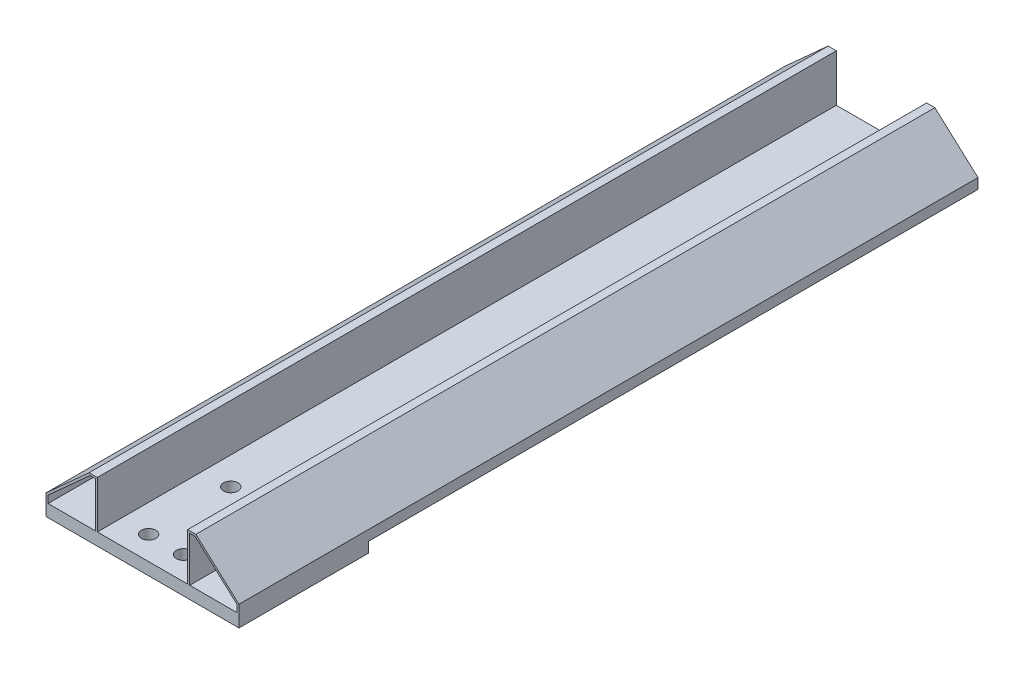
ISO-10303-21;
HEADER;
FILE_DESCRIPTION(('STEP AP214'),'2;1');
FILE_NAME('part.step','',(''),(''),'','','');
FILE_SCHEMA(('AUTOMOTIVE_DESIGN { 1 0 10303 214 1 1 1 1 }'));
ENDSEC;
DATA;
#1=APPLICATION_CONTEXT('core data for automotive mechanical design processes');
#2=APPLICATION_PROTOCOL_DEFINITION('international standard','automotive_design',2000,#1);
#3=PRODUCT_CONTEXT('',#1,'mechanical');
#4=PRODUCT('Part','Part','',(#3));
#5=PRODUCT_RELATED_PRODUCT_CATEGORY('part','',(#4));
#6=PRODUCT_DEFINITION_FORMATION('','',#4);
#7=PRODUCT_DEFINITION_CONTEXT('part definition',#1,'design');
#8=PRODUCT_DEFINITION('design','',#6,#7);
#9=PRODUCT_DEFINITION_SHAPE('','',#8);
#10=(LENGTH_UNIT() NAMED_UNIT(*) SI_UNIT(.MILLI.,.METRE.));
#11=(NAMED_UNIT(*) PLANE_ANGLE_UNIT() SI_UNIT($,.RADIAN.));
#12=(NAMED_UNIT(*) SI_UNIT($,.STERADIAN.) SOLID_ANGLE_UNIT());
#13=UNCERTAINTY_MEASURE_WITH_UNIT(LENGTH_MEASURE(1.E-05),#10,'distance_accuracy_value','');
#14=(GEOMETRIC_REPRESENTATION_CONTEXT(3) GLOBAL_UNCERTAINTY_ASSIGNED_CONTEXT((#13)) GLOBAL_UNIT_ASSIGNED_CONTEXT((#10,
#11,#12)) REPRESENTATION_CONTEXT('',''));
#15=CARTESIAN_POINT('',(0.,0.,0.));
#16=DIRECTION('',(0.,0.,1.));
#17=DIRECTION('',(1.,0.,0.));
#18=AXIS2_PLACEMENT_3D('',#15,#16,#17);
#19=CARTESIAN_POINT('',(0.,-24.,360.));
#20=DIRECTION('',(0.,1.,0.));
#21=DIRECTION('',(0.,0.,1.));
#22=AXIS2_PLACEMENT_3D('',#19,#20,#21);
#23=PLANE('',#22);
#24=DIRECTION('',(1.,0.,0.));
#25=VECTOR('',#24,1.);
#26=CARTESIAN_POINT('',(0.,-24.,297.));
#27=LINE('',#26,#25);
#28=CARTESIAN_POINT('',(0.,-24.,297.));
#29=VERTEX_POINT('',#28);
#30=CARTESIAN_POINT('',(94.,-24.,297.));
#31=VERTEX_POINT('',#30);
#32=EDGE_CURVE('E53',#29,#31,#27,.T.);
#33=ORIENTED_EDGE('',*,*,#32,.F.);
#34=DIRECTION('',(0.,0.,-1.));
#35=VECTOR('',#34,1.);
#36=CARTESIAN_POINT('',(0.,-24.,360.));
#37=LINE('',#36,#35);
#38=CARTESIAN_POINT('',(0.,-24.,0.));
#39=VERTEX_POINT('',#38);
#40=EDGE_CURVE('E11',#29,#39,#37,.T.);
#41=ORIENTED_EDGE('',*,*,#40,.T.);
#42=DIRECTION('',(1.,0.,0.));
#43=VECTOR('',#42,1.);
#44=CARTESIAN_POINT('',(0.,-24.,0.));
#45=LINE('',#44,#43);
#46=CARTESIAN_POINT('',(94.,-24.,0.));
#47=VERTEX_POINT('',#46);
#48=EDGE_CURVE('E348',#39,#47,#45,.T.);
#49=ORIENTED_EDGE('',*,*,#48,.T.);
#50=DIRECTION('',(0.,0.,-1.));
#51=VECTOR('',#50,1.);
#52=CARTESIAN_POINT('',(94.,-24.,360.));
#53=LINE('',#52,#51);
#54=EDGE_CURVE('E47',#31,#47,#53,.T.);
#55=ORIENTED_EDGE('',*,*,#54,.F.);
#56=EDGE_LOOP('',(#33,#41,#49,#55));
#57=FACE_BOUND('',#56,.T.);
#58=ADVANCED_FACE('F39',(#57),#23,.F.);
#59=CARTESIAN_POINT('',(94.,0.,360.));
#60=DIRECTION('',(-1.,0.,0.));
#61=DIRECTION('',(0.,0.,1.));
#62=AXIS2_PLACEMENT_3D('',#59,#60,#61);
#63=PLANE('',#62);
#64=DIRECTION('',(0.,0.,-1.));
#65=VECTOR('',#64,1.);
#66=CARTESIAN_POINT('',(94.,-19.,360.));
#67=LINE('',#66,#65);
#68=CARTESIAN_POINT('',(94.,-19.,360.));
#69=VERTEX_POINT('',#68);
#70=CARTESIAN_POINT('',(94.,-19.,0.));
#71=VERTEX_POINT('',#70);
#72=EDGE_CURVE('E298',#69,#71,#67,.T.);
#73=ORIENTED_EDGE('',*,*,#72,.F.);
#74=DIRECTION('',(0.,1.,0.));
#75=VECTOR('',#74,1.);
#76=CARTESIAN_POINT('',(94.,0.,360.));
#77=LINE('',#76,#75);
#78=CARTESIAN_POINT('',(94.,-29.,360.));
#79=VERTEX_POINT('',#78);
#80=EDGE_CURVE('E339',#79,#69,#77,.T.);
#81=ORIENTED_EDGE('',*,*,#80,.F.);
#82=DIRECTION('',(0.,0.,1.));
#83=VECTOR('',#82,1.);
#84=CARTESIAN_POINT('',(94.,-29.,360.));
#85=LINE('',#84,#83);
#86=CARTESIAN_POINT('',(94.,-29.,297.));
#87=VERTEX_POINT('',#86);
#88=EDGE_CURVE('E197',#87,#79,#85,.T.);
#89=ORIENTED_EDGE('',*,*,#88,.F.);
#90=DIRECTION('',(0.,1.,0.));
#91=VECTOR('',#90,1.);
#92=CARTESIAN_POINT('',(94.,-29.,297.));
#93=LINE('',#92,#91);
#94=EDGE_CURVE('E193',#87,#31,#93,.T.);
#95=ORIENTED_EDGE('',*,*,#94,.T.);
#96=ORIENTED_EDGE('',*,*,#54,.T.);
#97=DIRECTION('',(0.,1.,0.));
#98=VECTOR('',#97,1.);
#99=CARTESIAN_POINT('',(94.,0.,0.));
#100=LINE('',#99,#98);
#101=EDGE_CURVE('E351',#47,#71,#100,.T.);
#102=ORIENTED_EDGE('',*,*,#101,.T.);
#103=EDGE_LOOP('',(#73,#81,#89,#95,#96,#102));
#104=FACE_BOUND('',#103,.T.);
#105=ADVANCED_FACE('F441',(#104),#63,.F.);
#106=CARTESIAN_POINT('',(0.,0.,360.));
#107=DIRECTION('',(0.,-1.,0.));
#108=DIRECTION('',(0.,0.,-1.));
#109=AXIS2_PLACEMENT_3D('',#106,#107,#108);
#110=PLANE('',#109);
#111=DIRECTION('',(0.,0.,-1.));
#112=VECTOR('',#111,1.);
#113=CARTESIAN_POINT('',(73.,0.,360.));
#114=LINE('',#113,#112);
#115=CARTESIAN_POINT('',(73.,0.,360.));
#116=VERTEX_POINT('',#115);
#117=CARTESIAN_POINT('',(73.,0.,0.));
#118=VERTEX_POINT('',#117);
#119=EDGE_CURVE('E293',#116,#118,#114,.T.);
#120=ORIENTED_EDGE('',*,*,#119,.T.);
#121=DIRECTION('',(-1.,0.,0.));
#122=VECTOR('',#121,1.);
#123=CARTESIAN_POINT('',(0.,0.,0.));
#124=LINE('',#123,#122);
#125=CARTESIAN_POINT('',(69.,0.,0.));
#126=VERTEX_POINT('',#125);
#127=EDGE_CURVE('E340',#118,#126,#124,.T.);
#128=ORIENTED_EDGE('',*,*,#127,.T.);
#129=DIRECTION('',(0.,0.,-1.));
#130=VECTOR('',#129,1.);
#131=CARTESIAN_POINT('',(69.,0.,360.));
#132=LINE('',#131,#130);
#133=CARTESIAN_POINT('',(69.,0.,360.));
#134=VERTEX_POINT('',#133);
#135=EDGE_CURVE('E322',#134,#126,#132,.T.);
#136=ORIENTED_EDGE('',*,*,#135,.F.);
#137=DIRECTION('',(-1.,0.,0.));
#138=VECTOR('',#137,1.);
#139=CARTESIAN_POINT('',(0.,0.,360.));
#140=LINE('',#139,#138);
#141=EDGE_CURVE('E346',#116,#134,#140,.T.);
#142=ORIENTED_EDGE('',*,*,#141,.F.);
#143=EDGE_LOOP('',(#120,#128,#136,#142));
#144=FACE_BOUND('',#143,.T.);
#145=ADVANCED_FACE('F366',(#144),#110,.F.);
#146=CARTESIAN_POINT('',(0.,0.,360.));
#147=DIRECTION('',(0.,0.,1.));
#148=DIRECTION('',(1.,0.,0.));
#149=AXIS2_PLACEMENT_3D('',#146,#147,#148);
#150=PLANE('',#149);
#151=DIRECTION('',(0.741535779123771,0.670913323969126,0.));
#152=VECTOR('',#151,1.);
#153=CARTESIAN_POINT('',(10.1235317778345,-11.189166701817,360.));
#154=LINE('',#153,#152);
#155=CARTESIAN_POINT('',(1.,-19.4437906912863,360.));
#156=VERTEX_POINT('',#155);
#157=CARTESIAN_POINT('',(21.3852423430007,-1.,360.));
#158=VERTEX_POINT('',#157);
#159=EDGE_CURVE('E216',#156,#158,#154,.T.);
#160=ORIENTED_EDGE('',*,*,#159,.T.);
#161=DIRECTION('',(1.,0.,0.));
#162=VECTOR('',#161,1.);
#163=CARTESIAN_POINT('',(0.,-1.,360.));
#164=LINE('',#163,#162);
#165=CARTESIAN_POINT('',(24.,-1.,360.));
#166=VERTEX_POINT('',#165);
#167=EDGE_CURVE('E219',#158,#166,#164,.T.);
#168=ORIENTED_EDGE('',*,*,#167,.T.);
#169=DIRECTION('',(0.,-1.,0.));
#170=VECTOR('',#169,1.);
#171=CARTESIAN_POINT('',(24.,0.,360.));
#172=LINE('',#171,#170);
#173=CARTESIAN_POINT('',(24.,-23.,360.));
#174=VERTEX_POINT('',#173);
#175=EDGE_CURVE('E61',#166,#174,#172,.T.);
#176=ORIENTED_EDGE('',*,*,#175,.T.);
#177=DIRECTION('',(-1.,0.,0.));
#178=VECTOR('',#177,1.);
#179=CARTESIAN_POINT('',(0.,-23.,360.));
#180=LINE('',#179,#178);
#181=CARTESIAN_POINT('',(1.,-23.,360.));
#182=VERTEX_POINT('',#181);
#183=EDGE_CURVE('E224',#174,#182,#180,.T.);
#184=ORIENTED_EDGE('',*,*,#183,.T.);
#185=DIRECTION('',(0.,1.,0.));
#186=VECTOR('',#185,1.);
#187=CARTESIAN_POINT('',(1.,0.,360.));
#188=LINE('',#187,#186);
#189=EDGE_CURVE('E227',#182,#156,#188,.T.);
#190=ORIENTED_EDGE('',*,*,#189,.T.);
#191=EDGE_LOOP('',(#160,#168,#176,#184,#190));
#192=FACE_BOUND('',#191,.T.);
#193=DIRECTION('',(0.,-1.,0.));
#194=VECTOR('',#193,1.);
#195=CARTESIAN_POINT('',(93.,0.,360.));
#196=LINE('',#195,#194);
#197=CARTESIAN_POINT('',(93.,-19.4437906912863,360.));
#198=VERTEX_POINT('',#197);
#199=CARTESIAN_POINT('',(93.,-23.,360.));
#200=VERTEX_POINT('',#199);
#201=EDGE_CURVE('E252',#198,#200,#196,.T.);
#202=ORIENTED_EDGE('',*,*,#201,.T.);
#203=DIRECTION('',(-1.,0.,0.));
#204=VECTOR('',#203,1.);
#205=CARTESIAN_POINT('',(0.,-23.,360.));
#206=LINE('',#205,#204);
#207=CARTESIAN_POINT('',(70.,-23.,360.));
#208=VERTEX_POINT('',#207);
#209=EDGE_CURVE('E255',#200,#208,#206,.T.);
#210=ORIENTED_EDGE('',*,*,#209,.T.);
#211=DIRECTION('',(0.,-1.,0.));
#212=VECTOR('',#211,1.);
#213=CARTESIAN_POINT('',(70.,0.,360.));
#214=LINE('',#213,#212);
#215=CARTESIAN_POINT('',(70.,-1.,360.));
#216=VERTEX_POINT('',#215);
#217=EDGE_CURVE('E259',#216,#208,#214,.T.);
#218=ORIENTED_EDGE('',*,*,#217,.F.);
#219=DIRECTION('',(-1.,0.,0.));
#220=VECTOR('',#219,1.);
#221=CARTESIAN_POINT('',(0.,-1.,360.));
#222=LINE('',#221,#220);
#223=CARTESIAN_POINT('',(72.6147576569993,-1.,360.));
#224=VERTEX_POINT('',#223);
#225=EDGE_CURVE('E262',#224,#216,#222,.T.);
#226=ORIENTED_EDGE('',*,*,#225,.F.);
#227=DIRECTION('',(0.741535779123771,-0.670913323969127,0.));
#228=VECTOR('',#227,1.);
#229=CARTESIAN_POINT('',(32.1881889204199,35.5764193330957,360.));
#230=LINE('',#229,#228);
#231=EDGE_CURVE('E264',#224,#198,#230,.T.);
#232=ORIENTED_EDGE('',*,*,#231,.T.);
#233=EDGE_LOOP('',(#202,#210,#218,#226,#232));
#234=FACE_BOUND('',#233,.T.);
#235=ORIENTED_EDGE('',*,*,#80,.T.);
#236=DIRECTION('',(0.741535779123771,-0.670913323969127,0.));
#237=VECTOR('',#236,1.);
#238=CARTESIAN_POINT('',(32.8591022443891,36.3179551122195,360.));
#239=LINE('',#238,#237);
#240=EDGE_CURVE('E291',#116,#69,#239,.T.);
#241=ORIENTED_EDGE('',*,*,#240,.F.);
#242=ORIENTED_EDGE('',*,*,#141,.T.);
#243=DIRECTION('',(0.,1.,0.));
#244=VECTOR('',#243,1.);
#245=CARTESIAN_POINT('',(69.,0.,360.));
#246=LINE('',#245,#244);
#247=CARTESIAN_POINT('',(69.,-23.,360.));
#248=VERTEX_POINT('',#247);
#249=EDGE_CURVE('E309',#248,#134,#246,.T.);
#250=ORIENTED_EDGE('',*,*,#249,.F.);
#251=DIRECTION('',(1.,0.,0.));
#252=VECTOR('',#251,1.);
#253=CARTESIAN_POINT('',(0.,-23.,360.));
#254=LINE('',#253,#252);
#255=CARTESIAN_POINT('',(25.,-23.,360.));
#256=VERTEX_POINT('',#255);
#257=EDGE_CURVE('E303',#256,#248,#254,.T.);
#258=ORIENTED_EDGE('',*,*,#257,.F.);
#259=DIRECTION('',(0.,1.,0.));
#260=VECTOR('',#259,1.);
#261=CARTESIAN_POINT('',(25.,0.,360.));
#262=LINE('',#261,#260);
#263=CARTESIAN_POINT('',(25.,0.,360.));
#264=VERTEX_POINT('',#263);
#265=EDGE_CURVE('E305',#256,#264,#262,.T.);
#266=ORIENTED_EDGE('',*,*,#265,.T.);
#267=CARTESIAN_POINT('',(21.,0.,360.));
#268=VERTEX_POINT('',#267);
#269=EDGE_CURVE('E343',#264,#268,#140,.T.);
#270=ORIENTED_EDGE('',*,*,#269,.T.);
#271=DIRECTION('',(-0.741535779123771,-0.670913323969126,0.));
#272=VECTOR('',#271,1.);
#273=CARTESIAN_POINT('',(9.45261845386534,-10.4476309226933,360.));
#274=LINE('',#273,#272);
#275=CARTESIAN_POINT('',(0.,-19.,360.));
#276=VERTEX_POINT('',#275);
#277=EDGE_CURVE('E329',#268,#276,#274,.T.);
#278=ORIENTED_EDGE('',*,*,#277,.T.);
#279=DIRECTION('',(0.,-1.,0.));
#280=VECTOR('',#279,1.);
#281=CARTESIAN_POINT('',(0.,0.,360.));
#282=LINE('',#281,#280);
#283=CARTESIAN_POINT('',(0.,-29.,360.));
#284=VERTEX_POINT('',#283);
#285=EDGE_CURVE('E337',#276,#284,#282,.T.);
#286=ORIENTED_EDGE('',*,*,#285,.T.);
#287=DIRECTION('',(-1.,0.,0.));
#288=VECTOR('',#287,1.);
#289=CARTESIAN_POINT('',(0.,-29.,360.));
#290=LINE('',#289,#288);
#291=EDGE_CURVE('E204',#79,#284,#290,.T.);
#292=ORIENTED_EDGE('',*,*,#291,.F.);
#293=EDGE_LOOP('',(#235,#241,#242,#250,#258,#266,#270,#278,#286,#292));
#294=FACE_BOUND('',#293,.T.);
#295=ADVANCED_FACE('F362',(#192,#234,#294),#150,.T.);
#296=CARTESIAN_POINT('',(0.,0.,0.));
#297=DIRECTION('',(0.,0.,1.));
#298=DIRECTION('',(1.,0.,0.));
#299=AXIS2_PLACEMENT_3D('',#296,#297,#298);
#300=PLANE('',#299);
#301=DIRECTION('',(1.,0.,0.));
#302=VECTOR('',#301,1.);
#303=CARTESIAN_POINT('',(0.,-1.,0.));
#304=LINE('',#303,#302);
#305=CARTESIAN_POINT('',(21.3852423430007,-1.,0.));
#306=VERTEX_POINT('',#305);
#307=CARTESIAN_POINT('',(24.,-1.,0.));
#308=VERTEX_POINT('',#307);
#309=EDGE_CURVE('E211',#306,#308,#304,.T.);
#310=ORIENTED_EDGE('',*,*,#309,.F.);
#311=DIRECTION('',(0.741535779123771,0.670913323969126,0.));
#312=VECTOR('',#311,1.);
#313=CARTESIAN_POINT('',(10.1235317778345,-11.189166701817,0.));
#314=LINE('',#313,#312);
#315=CARTESIAN_POINT('',(1.,-19.4437906912863,0.));
#316=VERTEX_POINT('',#315);
#317=EDGE_CURVE('E209',#316,#306,#314,.T.);
#318=ORIENTED_EDGE('',*,*,#317,.F.);
#319=DIRECTION('',(0.,1.,0.));
#320=VECTOR('',#319,1.);
#321=CARTESIAN_POINT('',(1.,0.,0.));
#322=LINE('',#321,#320);
#323=CARTESIAN_POINT('',(1.,-23.,0.));
#324=VERTEX_POINT('',#323);
#325=EDGE_CURVE('E220',#324,#316,#322,.T.);
#326=ORIENTED_EDGE('',*,*,#325,.F.);
#327=DIRECTION('',(-1.,0.,0.));
#328=VECTOR('',#327,1.);
#329=CARTESIAN_POINT('',(0.,-23.,0.));
#330=LINE('',#329,#328);
#331=CARTESIAN_POINT('',(24.,-23.,0.));
#332=VERTEX_POINT('',#331);
#333=EDGE_CURVE('E236',#332,#324,#330,.T.);
#334=ORIENTED_EDGE('',*,*,#333,.F.);
#335=DIRECTION('',(0.,-1.,0.));
#336=VECTOR('',#335,1.);
#337=CARTESIAN_POINT('',(24.,0.,0.));
#338=LINE('',#337,#336);
#339=EDGE_CURVE('E233',#308,#332,#338,.T.);
#340=ORIENTED_EDGE('',*,*,#339,.F.);
#341=EDGE_LOOP('',(#310,#318,#326,#334,#340));
#342=FACE_BOUND('',#341,.T.);
#343=DIRECTION('',(-1.,0.,0.));
#344=VECTOR('',#343,1.);
#345=CARTESIAN_POINT('',(0.,-23.,0.));
#346=LINE('',#345,#344);
#347=CARTESIAN_POINT('',(93.,-23.,0.));
#348=VERTEX_POINT('',#347);
#349=CARTESIAN_POINT('',(70.,-23.,0.));
#350=VERTEX_POINT('',#349);
#351=EDGE_CURVE('E269',#348,#350,#346,.T.);
#352=ORIENTED_EDGE('',*,*,#351,.F.);
#353=DIRECTION('',(0.,-1.,0.));
#354=VECTOR('',#353,1.);
#355=CARTESIAN_POINT('',(93.,0.,0.));
#356=LINE('',#355,#354);
#357=CARTESIAN_POINT('',(93.,-19.4437906912863,0.));
#358=VERTEX_POINT('',#357);
#359=EDGE_CURVE('E243',#358,#348,#356,.T.);
#360=ORIENTED_EDGE('',*,*,#359,.F.);
#361=DIRECTION('',(0.741535779123771,-0.670913323969127,0.));
#362=VECTOR('',#361,1.);
#363=CARTESIAN_POINT('',(32.1881889204199,35.5764193330957,0.));
#364=LINE('',#363,#362);
#365=CARTESIAN_POINT('',(72.6147576569993,-1.,0.));
#366=VERTEX_POINT('',#365);
#367=EDGE_CURVE('E256',#366,#358,#364,.T.);
#368=ORIENTED_EDGE('',*,*,#367,.F.);
#369=DIRECTION('',(-1.,0.,0.));
#370=VECTOR('',#369,1.);
#371=CARTESIAN_POINT('',(0.,-1.,0.));
#372=LINE('',#371,#370);
#373=CARTESIAN_POINT('',(70.,-1.,0.));
#374=VERTEX_POINT('',#373);
#375=EDGE_CURVE('E275',#366,#374,#372,.T.);
#376=ORIENTED_EDGE('',*,*,#375,.T.);
#377=DIRECTION('',(0.,-1.,0.));
#378=VECTOR('',#377,1.);
#379=CARTESIAN_POINT('',(70.,0.,0.));
#380=LINE('',#379,#378);
#381=EDGE_CURVE('E272',#374,#350,#380,.T.);
#382=ORIENTED_EDGE('',*,*,#381,.T.);
#383=EDGE_LOOP('',(#352,#360,#368,#376,#382));
#384=FACE_BOUND('',#383,.T.);
#385=DIRECTION('',(0.741535779123771,-0.670913323969127,0.));
#386=VECTOR('',#385,1.);
#387=CARTESIAN_POINT('',(32.8591022443891,36.3179551122195,0.));
#388=LINE('',#387,#386);
#389=EDGE_CURVE('E294',#118,#71,#388,.T.);
#390=ORIENTED_EDGE('',*,*,#389,.T.);
#391=ORIENTED_EDGE('',*,*,#101,.F.);
#392=ORIENTED_EDGE('',*,*,#48,.F.);
#393=DIRECTION('',(0.,-1.,0.));
#394=VECTOR('',#393,1.);
#395=CARTESIAN_POINT('',(0.,0.,0.));
#396=LINE('',#395,#394);
#397=CARTESIAN_POINT('',(0.,-19.,0.));
#398=VERTEX_POINT('',#397);
#399=EDGE_CURVE('E300',#398,#39,#396,.T.);
#400=ORIENTED_EDGE('',*,*,#399,.F.);
#401=DIRECTION('',(-0.741535779123771,-0.670913323969126,0.));
#402=VECTOR('',#401,1.);
#403=CARTESIAN_POINT('',(9.45261845386534,-10.4476309226933,0.));
#404=LINE('',#403,#402);
#405=CARTESIAN_POINT('',(21.,0.,0.));
#406=VERTEX_POINT('',#405);
#407=EDGE_CURVE('E282',#406,#398,#404,.T.);
#408=ORIENTED_EDGE('',*,*,#407,.F.);
#409=CARTESIAN_POINT('',(25.,0.,0.));
#410=VERTEX_POINT('',#409);
#411=EDGE_CURVE('E354',#410,#406,#124,.T.);
#412=ORIENTED_EDGE('',*,*,#411,.F.);
#413=DIRECTION('',(0.,1.,0.));
#414=VECTOR('',#413,1.);
#415=CARTESIAN_POINT('',(25.,0.,0.));
#416=LINE('',#415,#414);
#417=CARTESIAN_POINT('',(25.,-23.,0.));
#418=VERTEX_POINT('',#417);
#419=EDGE_CURVE('E315',#418,#410,#416,.T.);
#420=ORIENTED_EDGE('',*,*,#419,.F.);
#421=DIRECTION('',(1.,0.,0.));
#422=VECTOR('',#421,1.);
#423=CARTESIAN_POINT('',(0.,-23.,0.));
#424=LINE('',#423,#422);
#425=CARTESIAN_POINT('',(69.,-23.,0.));
#426=VERTEX_POINT('',#425);
#427=EDGE_CURVE('E312',#418,#426,#424,.T.);
#428=ORIENTED_EDGE('',*,*,#427,.T.);
#429=DIRECTION('',(0.,1.,0.));
#430=VECTOR('',#429,1.);
#431=CARTESIAN_POINT('',(69.,0.,0.));
#432=LINE('',#431,#430);
#433=EDGE_CURVE('E306',#426,#126,#432,.T.);
#434=ORIENTED_EDGE('',*,*,#433,.T.);
#435=ORIENTED_EDGE('',*,*,#127,.F.);
#436=EDGE_LOOP('',(#390,#391,#392,#400,#408,#412,#420,#428,#434,#435));
#437=FACE_BOUND('',#436,.T.);
#438=ADVANCED_FACE('F373',(#342,#384,#437),#300,.F.);
#439=CARTESIAN_POINT('',(0.,0.,360.));
#440=DIRECTION('',(1.,0.,0.));
#441=DIRECTION('',(0.,1.,0.));
#442=AXIS2_PLACEMENT_3D('',#439,#440,#441);
#443=PLANE('',#442);
#444=ORIENTED_EDGE('',*,*,#285,.F.);
#445=DIRECTION('',(0.,0.,-1.));
#446=VECTOR('',#445,1.);
#447=CARTESIAN_POINT('',(0.,-19.,360.));
#448=LINE('',#447,#446);
#449=EDGE_CURVE('E316',#276,#398,#448,.T.);
#450=ORIENTED_EDGE('',*,*,#449,.T.);
#451=ORIENTED_EDGE('',*,*,#399,.T.);
#452=ORIENTED_EDGE('',*,*,#40,.F.);
#453=DIRECTION('',(0.,1.,0.));
#454=VECTOR('',#453,1.);
#455=CARTESIAN_POINT('',(0.,-29.,297.));
#456=LINE('',#455,#454);
#457=CARTESIAN_POINT('',(0.,-29.,297.));
#458=VERTEX_POINT('',#457);
#459=EDGE_CURVE('E191',#458,#29,#456,.T.);
#460=ORIENTED_EDGE('',*,*,#459,.F.);
#461=DIRECTION('',(0.,0.,-1.));
#462=VECTOR('',#461,1.);
#463=CARTESIAN_POINT('',(0.,-29.,360.));
#464=LINE('',#463,#462);
#465=EDGE_CURVE('E198',#284,#458,#464,.T.);
#466=ORIENTED_EDGE('',*,*,#465,.F.);
#467=EDGE_LOOP('',(#444,#450,#451,#452,#460,#466));
#468=FACE_BOUND('',#467,.T.);
#469=ADVANCED_FACE('F41',(#468),#443,.F.);
#470=ORIENTED_EDGE('',*,*,#269,.F.);
#471=DIRECTION('',(0.,0.,-1.));
#472=VECTOR('',#471,1.);
#473=CARTESIAN_POINT('',(25.,0.,360.));
#474=LINE('',#473,#472);
#475=EDGE_CURVE('E324',#264,#410,#474,.T.);
#476=ORIENTED_EDGE('',*,*,#475,.T.);
#477=ORIENTED_EDGE('',*,*,#411,.T.);
#478=DIRECTION('',(0.,0.,-1.));
#479=VECTOR('',#478,1.);
#480=CARTESIAN_POINT('',(21.,0.,360.));
#481=LINE('',#480,#479);
#482=EDGE_CURVE('E332',#268,#406,#481,.T.);
#483=ORIENTED_EDGE('',*,*,#482,.F.);
#484=EDGE_LOOP('',(#470,#476,#477,#483));
#485=FACE_BOUND('',#484,.T.);
#486=ADVANCED_FACE('F384',(#485),#110,.F.);
#487=CARTESIAN_POINT('',(9.45261845386534,-10.4476309226933,360.));
#488=DIRECTION('',(0.670913323969126,-0.741535779123771,0.));
#489=DIRECTION('',(0.741535779123771,0.670913323969126,0.));
#490=AXIS2_PLACEMENT_3D('',#487,#488,#489);
#491=PLANE('',#490);
#492=ORIENTED_EDGE('',*,*,#407,.T.);
#493=ORIENTED_EDGE('',*,*,#449,.F.);
#494=ORIENTED_EDGE('',*,*,#277,.F.);
#495=ORIENTED_EDGE('',*,*,#482,.T.);
#496=EDGE_LOOP('',(#492,#493,#494,#495));
#497=FACE_BOUND('',#496,.T.);
#498=ADVANCED_FACE('F387',(#497),#491,.F.);
#499=CARTESIAN_POINT('',(0.,-23.,360.));
#500=DIRECTION('',(0.,1.,0.));
#501=DIRECTION('',(0.,0.,1.));
#502=AXIS2_PLACEMENT_3D('',#499,#500,#501);
#503=PLANE('',#502);
#504=CARTESIAN_POINT('',(55.5,-23.,348.5));
#505=DIRECTION('',(0.,1.,0.));
#506=DIRECTION('',(0.,0.,1.));
#507=AXIS2_PLACEMENT_3D('',#504,#505,#506);
#508=CIRCLE('',#507,3.50000000000001);
#509=CARTESIAN_POINT('',(55.5,-23.,352.));
#510=VERTEX_POINT('',#509);
#511=EDGE_CURVE('E393',#510,#510,#508,.T.);
#512=ORIENTED_EDGE('',*,*,#511,.F.);
#513=EDGE_LOOP('',(#512));
#514=FACE_BOUND('',#513,.T.);
#515=CARTESIAN_POINT('',(38.5,-23.,308.5));
#516=DIRECTION('',(0.,1.,0.));
#517=DIRECTION('',(0.,0.,1.));
#518=AXIS2_PLACEMENT_3D('',#515,#516,#517);
#519=CIRCLE('',#518,3.5);
#520=CARTESIAN_POINT('',(38.5,-23.,312.));
#521=VERTEX_POINT('',#520);
#522=EDGE_CURVE('E395',#521,#521,#519,.T.);
#523=ORIENTED_EDGE('',*,*,#522,.F.);
#524=EDGE_LOOP('',(#523));
#525=FACE_BOUND('',#524,.T.);
#526=CARTESIAN_POINT('',(55.5,-23.,308.5));
#527=DIRECTION('',(0.,1.,0.));
#528=DIRECTION('',(0.,0.,1.));
#529=AXIS2_PLACEMENT_3D('',#526,#527,#528);
#530=CIRCLE('',#529,3.50000000000001);
#531=CARTESIAN_POINT('',(55.5,-23.,312.));
#532=VERTEX_POINT('',#531);
#533=EDGE_CURVE('E400',#532,#532,#530,.T.);
#534=ORIENTED_EDGE('',*,*,#533,.F.);
#535=EDGE_LOOP('',(#534));
#536=FACE_BOUND('',#535,.T.);
#537=CARTESIAN_POINT('',(38.5,-23.,348.5));
#538=DIRECTION('',(0.,1.,0.));
#539=DIRECTION('',(0.,0.,1.));
#540=AXIS2_PLACEMENT_3D('',#537,#538,#539);
#541=CIRCLE('',#540,3.50000000000002);
#542=CARTESIAN_POINT('',(38.5,-23.,352.));
#543=VERTEX_POINT('',#542);
#544=EDGE_CURVE('E405',#543,#543,#541,.T.);
#545=ORIENTED_EDGE('',*,*,#544,.F.);
#546=EDGE_LOOP('',(#545));
#547=FACE_BOUND('',#546,.T.);
#548=ORIENTED_EDGE('',*,*,#427,.F.);
#549=DIRECTION('',(0.,0.,-1.));
#550=VECTOR('',#549,1.);
#551=CARTESIAN_POINT('',(25.,-23.,360.));
#552=LINE('',#551,#550);
#553=EDGE_CURVE('E311',#256,#418,#552,.T.);
#554=ORIENTED_EDGE('',*,*,#553,.F.);
#555=ORIENTED_EDGE('',*,*,#257,.T.);
#556=DIRECTION('',(0.,0.,-1.));
#557=VECTOR('',#556,1.);
#558=CARTESIAN_POINT('',(69.,-23.,360.));
#559=LINE('',#558,#557);
#560=EDGE_CURVE('E297',#248,#426,#559,.T.);
#561=ORIENTED_EDGE('',*,*,#560,.T.);
#562=EDGE_LOOP('',(#548,#554,#555,#561));
#563=FACE_BOUND('',#562,.T.);
#564=ADVANCED_FACE('F377',(#514,#525,#536,#547,#563),#503,.T.);
#565=CARTESIAN_POINT('',(69.,0.,360.));
#566=DIRECTION('',(-1.,0.,0.));
#567=DIRECTION('',(0.,0.,1.));
#568=AXIS2_PLACEMENT_3D('',#565,#566,#567);
#569=PLANE('',#568);
#570=ORIENTED_EDGE('',*,*,#433,.F.);
#571=ORIENTED_EDGE('',*,*,#560,.F.);
#572=ORIENTED_EDGE('',*,*,#249,.T.);
#573=ORIENTED_EDGE('',*,*,#135,.T.);
#574=EDGE_LOOP('',(#570,#571,#572,#573));
#575=FACE_BOUND('',#574,.T.);
#576=ADVANCED_FACE('F370',(#575),#569,.T.);
#577=CARTESIAN_POINT('',(25.,0.,360.));
#578=DIRECTION('',(-1.,0.,0.));
#579=DIRECTION('',(0.,-1.,0.));
#580=AXIS2_PLACEMENT_3D('',#577,#578,#579);
#581=PLANE('',#580);
#582=ORIENTED_EDGE('',*,*,#419,.T.);
#583=ORIENTED_EDGE('',*,*,#475,.F.);
#584=ORIENTED_EDGE('',*,*,#265,.F.);
#585=ORIENTED_EDGE('',*,*,#553,.T.);
#586=EDGE_LOOP('',(#582,#583,#584,#585));
#587=FACE_BOUND('',#586,.T.);
#588=ADVANCED_FACE('F380',(#587),#581,.F.);
#589=CARTESIAN_POINT('',(32.8591022443891,36.3179551122195,360.));
#590=DIRECTION('',(0.670913323969126,0.741535779123771,0.));
#591=DIRECTION('',(-0.741535779123771,0.670913323969127,0.));
#592=AXIS2_PLACEMENT_3D('',#589,#590,#591);
#593=PLANE('',#592);
#594=ORIENTED_EDGE('',*,*,#389,.F.);
#595=ORIENTED_EDGE('',*,*,#119,.F.);
#596=ORIENTED_EDGE('',*,*,#240,.T.);
#597=ORIENTED_EDGE('',*,*,#72,.T.);
#598=EDGE_LOOP('',(#594,#595,#596,#597));
#599=FACE_BOUND('',#598,.T.);
#600=ADVANCED_FACE('F462',(#599),#593,.T.);
#601=CARTESIAN_POINT('',(93.,0.,360.));
#602=DIRECTION('',(1.,0.,0.));
#603=DIRECTION('',(0.,0.,-1.));
#604=AXIS2_PLACEMENT_3D('',#601,#602,#603);
#605=PLANE('',#604);
#606=ORIENTED_EDGE('',*,*,#359,.T.);
#607=DIRECTION('',(0.,0.,-1.));
#608=VECTOR('',#607,1.);
#609=CARTESIAN_POINT('',(93.,-23.,360.));
#610=LINE('',#609,#608);
#611=EDGE_CURVE('E267',#200,#348,#610,.T.);
#612=ORIENTED_EDGE('',*,*,#611,.F.);
#613=ORIENTED_EDGE('',*,*,#201,.F.);
#614=DIRECTION('',(0.,0.,-1.));
#615=VECTOR('',#614,1.);
#616=CARTESIAN_POINT('',(93.,-19.4437906912863,360.));
#617=LINE('',#616,#615);
#618=EDGE_CURVE('E280',#198,#358,#617,.T.);
#619=ORIENTED_EDGE('',*,*,#618,.T.);
#620=EDGE_LOOP('',(#606,#612,#613,#619));
#621=FACE_BOUND('',#620,.T.);
#622=ADVANCED_FACE('F467',(#621),#605,.F.);
#623=CARTESIAN_POINT('',(32.1881889204199,35.5764193330957,360.));
#624=DIRECTION('',(0.670913323969127,0.741535779123771,0.));
#625=DIRECTION('',(-0.741535779123771,0.670913323969127,0.));
#626=AXIS2_PLACEMENT_3D('',#623,#624,#625);
#627=PLANE('',#626);
#628=ORIENTED_EDGE('',*,*,#367,.T.);
#629=ORIENTED_EDGE('',*,*,#618,.F.);
#630=ORIENTED_EDGE('',*,*,#231,.F.);
#631=DIRECTION('',(0.,0.,-1.));
#632=VECTOR('',#631,1.);
#633=CARTESIAN_POINT('',(72.6147576569993,-1.,360.));
#634=LINE('',#633,#632);
#635=EDGE_CURVE('E283',#224,#366,#634,.T.);
#636=ORIENTED_EDGE('',*,*,#635,.T.);
#637=EDGE_LOOP('',(#628,#629,#630,#636));
#638=FACE_BOUND('',#637,.T.);
#639=ADVANCED_FACE('F471',(#638),#627,.F.);
#640=CARTESIAN_POINT('',(0.,-1.,360.));
#641=DIRECTION('',(0.,-1.,0.));
#642=DIRECTION('',(0.,0.,-1.));
#643=AXIS2_PLACEMENT_3D('',#640,#641,#642);
#644=PLANE('',#643);
#645=ORIENTED_EDGE('',*,*,#375,.F.);
#646=ORIENTED_EDGE('',*,*,#635,.F.);
#647=ORIENTED_EDGE('',*,*,#225,.T.);
#648=DIRECTION('',(0.,0.,-1.));
#649=VECTOR('',#648,1.);
#650=CARTESIAN_POINT('',(70.,-1.,360.));
#651=LINE('',#650,#649);
#652=EDGE_CURVE('E285',#216,#374,#651,.T.);
#653=ORIENTED_EDGE('',*,*,#652,.T.);
#654=EDGE_LOOP('',(#645,#646,#647,#653));
#655=FACE_BOUND('',#654,.T.);
#656=ADVANCED_FACE('F481',(#655),#644,.T.);
#657=CARTESIAN_POINT('',(70.,0.,360.));
#658=DIRECTION('',(1.,0.,0.));
#659=DIRECTION('',(0.,0.,-1.));
#660=AXIS2_PLACEMENT_3D('',#657,#658,#659);
#661=PLANE('',#660);
#662=ORIENTED_EDGE('',*,*,#381,.F.);
#663=ORIENTED_EDGE('',*,*,#652,.F.);
#664=ORIENTED_EDGE('',*,*,#217,.T.);
#665=DIRECTION('',(0.,0.,-1.));
#666=VECTOR('',#665,1.);
#667=CARTESIAN_POINT('',(70.,-23.,360.));
#668=LINE('',#667,#666);
#669=EDGE_CURVE('E287',#208,#350,#668,.T.);
#670=ORIENTED_EDGE('',*,*,#669,.T.);
#671=EDGE_LOOP('',(#662,#663,#664,#670));
#672=FACE_BOUND('',#671,.T.);
#673=ADVANCED_FACE('F477',(#672),#661,.T.);
#674=CARTESIAN_POINT('',(0.,-23.,360.));
#675=DIRECTION('',(0.,-1.,0.));
#676=DIRECTION('',(0.,0.,-1.));
#677=AXIS2_PLACEMENT_3D('',#674,#675,#676);
#678=PLANE('',#677);
#679=ORIENTED_EDGE('',*,*,#351,.T.);
#680=ORIENTED_EDGE('',*,*,#669,.F.);
#681=ORIENTED_EDGE('',*,*,#209,.F.);
#682=ORIENTED_EDGE('',*,*,#611,.T.);
#683=EDGE_LOOP('',(#679,#680,#681,#682));
#684=FACE_BOUND('',#683,.T.);
#685=ADVANCED_FACE('F473',(#684),#678,.F.);
#686=CARTESIAN_POINT('',(10.1235317778345,-11.189166701817,360.));
#687=DIRECTION('',(-0.670913323969126,0.741535779123771,0.));
#688=DIRECTION('',(-0.741535779123771,-0.670913323969126,0.));
#689=AXIS2_PLACEMENT_3D('',#686,#687,#688);
#690=PLANE('',#689);
#691=ORIENTED_EDGE('',*,*,#317,.T.);
#692=DIRECTION('',(0.,0.,-1.));
#693=VECTOR('',#692,1.);
#694=CARTESIAN_POINT('',(21.3852423430007,-1.,360.));
#695=LINE('',#694,#693);
#696=EDGE_CURVE('E229',#158,#306,#695,.T.);
#697=ORIENTED_EDGE('',*,*,#696,.F.);
#698=ORIENTED_EDGE('',*,*,#159,.F.);
#699=DIRECTION('',(0.,0.,-1.));
#700=VECTOR('',#699,1.);
#701=CARTESIAN_POINT('',(1.,-19.4437906912863,360.));
#702=LINE('',#701,#700);
#703=EDGE_CURVE('E241',#156,#316,#702,.T.);
#704=ORIENTED_EDGE('',*,*,#703,.T.);
#705=EDGE_LOOP('',(#691,#697,#698,#704));
#706=FACE_BOUND('',#705,.T.);
#707=ADVANCED_FACE('F476',(#706),#690,.F.);
#708=CARTESIAN_POINT('',(1.,0.,360.));
#709=DIRECTION('',(-1.,0.,0.));
#710=DIRECTION('',(0.,0.,1.));
#711=AXIS2_PLACEMENT_3D('',#708,#709,#710);
#712=PLANE('',#711);
#713=ORIENTED_EDGE('',*,*,#325,.T.);
#714=ORIENTED_EDGE('',*,*,#703,.F.);
#715=ORIENTED_EDGE('',*,*,#189,.F.);
#716=DIRECTION('',(0.,0.,-1.));
#717=VECTOR('',#716,1.);
#718=CARTESIAN_POINT('',(1.,-23.,360.));
#719=LINE('',#718,#717);
#720=EDGE_CURVE('E244',#182,#324,#719,.T.);
#721=ORIENTED_EDGE('',*,*,#720,.T.);
#722=EDGE_LOOP('',(#713,#714,#715,#721));
#723=FACE_BOUND('',#722,.T.);
#724=ADVANCED_FACE('F491',(#723),#712,.F.);
#725=CARTESIAN_POINT('',(0.,-23.,360.));
#726=DIRECTION('',(0.,-1.,0.));
#727=DIRECTION('',(0.,0.,-1.));
#728=AXIS2_PLACEMENT_3D('',#725,#726,#727);
#729=PLANE('',#728);
#730=ORIENTED_EDGE('',*,*,#333,.T.);
#731=ORIENTED_EDGE('',*,*,#720,.F.);
#732=ORIENTED_EDGE('',*,*,#183,.F.);
#733=DIRECTION('',(0.,0.,-1.));
#734=VECTOR('',#733,1.);
#735=CARTESIAN_POINT('',(24.,-23.,360.));
#736=LINE('',#735,#734);
#737=EDGE_CURVE('E246',#174,#332,#736,.T.);
#738=ORIENTED_EDGE('',*,*,#737,.T.);
#739=EDGE_LOOP('',(#730,#731,#732,#738));
#740=FACE_BOUND('',#739,.T.);
#741=ADVANCED_FACE('F500',(#740),#729,.F.);
#742=CARTESIAN_POINT('',(24.,0.,360.));
#743=DIRECTION('',(1.,0.,0.));
#744=DIRECTION('',(0.,0.,-1.));
#745=AXIS2_PLACEMENT_3D('',#742,#743,#744);
#746=PLANE('',#745);
#747=ORIENTED_EDGE('',*,*,#339,.T.);
#748=ORIENTED_EDGE('',*,*,#737,.F.);
#749=ORIENTED_EDGE('',*,*,#175,.F.);
#750=DIRECTION('',(0.,0.,-1.));
#751=VECTOR('',#750,1.);
#752=CARTESIAN_POINT('',(24.,-1.,360.));
#753=LINE('',#752,#751);
#754=EDGE_CURVE('E248',#166,#308,#753,.T.);
#755=ORIENTED_EDGE('',*,*,#754,.T.);
#756=EDGE_LOOP('',(#747,#748,#749,#755));
#757=FACE_BOUND('',#756,.T.);
#758=ADVANCED_FACE('F496',(#757),#746,.F.);
#759=CARTESIAN_POINT('',(0.,-1.,360.));
#760=DIRECTION('',(0.,1.,0.));
#761=DIRECTION('',(0.,0.,1.));
#762=AXIS2_PLACEMENT_3D('',#759,#760,#761);
#763=PLANE('',#762);
#764=ORIENTED_EDGE('',*,*,#309,.T.);
#765=ORIENTED_EDGE('',*,*,#754,.F.);
#766=ORIENTED_EDGE('',*,*,#167,.F.);
#767=ORIENTED_EDGE('',*,*,#696,.T.);
#768=EDGE_LOOP('',(#764,#765,#766,#767));
#769=FACE_BOUND('',#768,.T.);
#770=ADVANCED_FACE('F493',(#769),#763,.F.);
#771=CARTESIAN_POINT('',(0.,-29.,297.));
#772=DIRECTION('',(0.,0.,1.));
#773=DIRECTION('',(1.,0.,0.));
#774=AXIS2_PLACEMENT_3D('',#771,#772,#773);
#775=PLANE('',#774);
#776=ORIENTED_EDGE('',*,*,#32,.T.);
#777=ORIENTED_EDGE('',*,*,#94,.F.);
#778=DIRECTION('',(1.,0.,0.));
#779=VECTOR('',#778,1.);
#780=CARTESIAN_POINT('',(0.,-29.,297.));
#781=LINE('',#780,#779);
#782=EDGE_CURVE('E187',#458,#87,#781,.T.);
#783=ORIENTED_EDGE('',*,*,#782,.F.);
#784=ORIENTED_EDGE('',*,*,#459,.T.);
#785=EDGE_LOOP('',(#776,#777,#783,#784));
#786=FACE_BOUND('',#785,.T.);
#787=ADVANCED_FACE('F189',(#786),#775,.F.);
#788=CARTESIAN_POINT('',(0.,-29.,0.));
#789=DIRECTION('',(0.,-1.,0.));
#790=DIRECTION('',(0.,0.,-1.));
#791=AXIS2_PLACEMENT_3D('',#788,#789,#790);
#792=PLANE('',#791);
#793=CARTESIAN_POINT('',(55.5,-29.,348.5));
#794=DIRECTION('',(0.,-1.,0.));
#795=DIRECTION('',(0.,0.,-1.));
#796=AXIS2_PLACEMENT_3D('',#793,#794,#795);
#797=CIRCLE('',#796,3.50000000000001);
#798=CARTESIAN_POINT('',(55.5,-29.,345.));
#799=VERTEX_POINT('',#798);
#800=EDGE_CURVE('E411',#799,#799,#797,.T.);
#801=ORIENTED_EDGE('',*,*,#800,.F.);
#802=EDGE_LOOP('',(#801));
#803=FACE_BOUND('',#802,.T.);
#804=CARTESIAN_POINT('',(38.5,-29.,308.5));
#805=DIRECTION('',(0.,-1.,0.));
#806=DIRECTION('',(0.,0.,-1.));
#807=AXIS2_PLACEMENT_3D('',#804,#805,#806);
#808=CIRCLE('',#807,3.5);
#809=CARTESIAN_POINT('',(38.5,-29.,305.));
#810=VERTEX_POINT('',#809);
#811=EDGE_CURVE('E412',#810,#810,#808,.T.);
#812=ORIENTED_EDGE('',*,*,#811,.F.);
#813=EDGE_LOOP('',(#812));
#814=FACE_BOUND('',#813,.T.);
#815=CARTESIAN_POINT('',(55.5,-29.,308.5));
#816=DIRECTION('',(0.,-1.,0.));
#817=DIRECTION('',(0.,0.,-1.));
#818=AXIS2_PLACEMENT_3D('',#815,#816,#817);
#819=CIRCLE('',#818,3.50000000000001);
#820=CARTESIAN_POINT('',(55.5,-29.,305.));
#821=VERTEX_POINT('',#820);
#822=EDGE_CURVE('E415',#821,#821,#819,.T.);
#823=ORIENTED_EDGE('',*,*,#822,.F.);
#824=EDGE_LOOP('',(#823));
#825=FACE_BOUND('',#824,.T.);
#826=CARTESIAN_POINT('',(38.5,-29.,348.5));
#827=DIRECTION('',(0.,-1.,0.));
#828=DIRECTION('',(0.,0.,-1.));
#829=AXIS2_PLACEMENT_3D('',#826,#827,#828);
#830=CIRCLE('',#829,3.50000000000002);
#831=CARTESIAN_POINT('',(38.5,-29.,345.));
#832=VERTEX_POINT('',#831);
#833=EDGE_CURVE('E408',#832,#832,#830,.T.);
#834=ORIENTED_EDGE('',*,*,#833,.F.);
#835=EDGE_LOOP('',(#834));
#836=FACE_BOUND('',#835,.T.);
#837=ORIENTED_EDGE('',*,*,#465,.T.);
#838=ORIENTED_EDGE('',*,*,#782,.T.);
#839=ORIENTED_EDGE('',*,*,#88,.T.);
#840=ORIENTED_EDGE('',*,*,#291,.T.);
#841=EDGE_LOOP('',(#837,#838,#839,#840));
#842=FACE_BOUND('',#841,.T.);
#843=ADVANCED_FACE('F202',(#803,#814,#825,#836,#842),#792,.T.);
#844=CARTESIAN_POINT('',(38.5,0.,348.5));
#845=DIRECTION('',(0.,-1.,0.));
#846=DIRECTION('',(0.,0.,-1.));
#847=AXIS2_PLACEMENT_3D('',#844,#845,#846);
#848=CYLINDRICAL_SURFACE('',#847,3.50000000000002);
#849=ORIENTED_EDGE('',*,*,#544,.T.);
#850=EDGE_LOOP('',(#849));
#851=FACE_BOUND('',#850,.T.);
#852=ORIENTED_EDGE('',*,*,#833,.T.);
#853=EDGE_LOOP('',(#852));
#854=FACE_BOUND('',#853,.T.);
#855=ADVANCED_FACE('F425',(#851,#854),#848,.F.);
#856=CARTESIAN_POINT('',(55.5,0.,308.5));
#857=DIRECTION('',(0.,-1.,0.));
#858=DIRECTION('',(0.,0.,-1.));
#859=AXIS2_PLACEMENT_3D('',#856,#857,#858);
#860=CYLINDRICAL_SURFACE('',#859,3.50000000000001);
#861=ORIENTED_EDGE('',*,*,#533,.T.);
#862=EDGE_LOOP('',(#861));
#863=FACE_BOUND('',#862,.T.);
#864=ORIENTED_EDGE('',*,*,#822,.T.);
#865=EDGE_LOOP('',(#864));
#866=FACE_BOUND('',#865,.T.);
#867=ADVANCED_FACE('F421',(#863,#866),#860,.F.);
#868=CARTESIAN_POINT('',(38.5,0.,308.5));
#869=DIRECTION('',(0.,-1.,0.));
#870=DIRECTION('',(0.,0.,-1.));
#871=AXIS2_PLACEMENT_3D('',#868,#869,#870);
#872=CYLINDRICAL_SURFACE('',#871,3.5);
#873=ORIENTED_EDGE('',*,*,#522,.T.);
#874=EDGE_LOOP('',(#873));
#875=FACE_BOUND('',#874,.T.);
#876=ORIENTED_EDGE('',*,*,#811,.T.);
#877=EDGE_LOOP('',(#876));
#878=FACE_BOUND('',#877,.T.);
#879=ADVANCED_FACE('F436',(#875,#878),#872,.F.);
#880=CARTESIAN_POINT('',(55.5,0.,348.5));
#881=DIRECTION('',(0.,-1.,0.));
#882=DIRECTION('',(0.,0.,-1.));
#883=AXIS2_PLACEMENT_3D('',#880,#881,#882);
#884=CYLINDRICAL_SURFACE('',#883,3.50000000000001);
#885=ORIENTED_EDGE('',*,*,#511,.T.);
#886=EDGE_LOOP('',(#885));
#887=FACE_BOUND('',#886,.T.);
#888=ORIENTED_EDGE('',*,*,#800,.T.);
#889=EDGE_LOOP('',(#888));
#890=FACE_BOUND('',#889,.T.);
#891=ADVANCED_FACE('F589',(#887,#890),#884,.F.);
#892=CLOSED_SHELL('',(#58,#105,#145,#295,#438,#469,#486,#498,#564,#576,#588,#600,#622,#639,#656,
#673,#685,#707,#724,#741,#758,#770,#787,#843,#855,#867,#879,#891));
#893=MANIFOLD_SOLID_BREP('B2',#892);
#894=ADVANCED_BREP_SHAPE_REPRESENTATION('',(#18,#893),#14);
#895=SHAPE_DEFINITION_REPRESENTATION(#9,#894);
ENDSEC;
END-ISO-10303-21;
